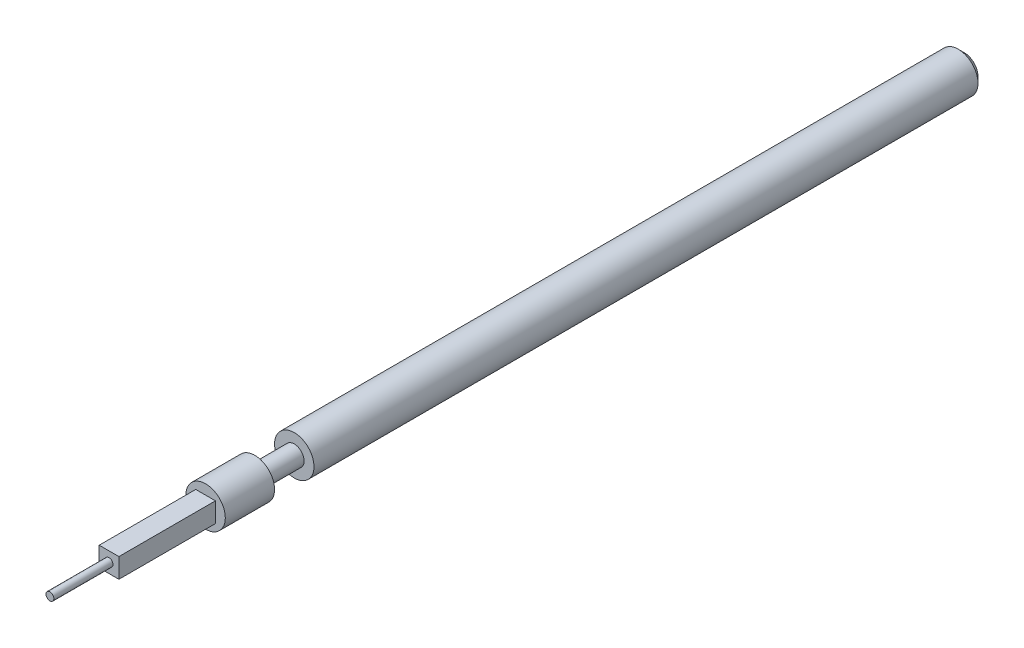
ISO-10303-21;
HEADER;
FILE_DESCRIPTION(('STEP AP214'),'2;1');
FILE_NAME('part.step','',(''),(''),'','','');
FILE_SCHEMA(('AUTOMOTIVE_DESIGN { 1 0 10303 214 1 1 1 1 }'));
ENDSEC;
DATA;
#1=APPLICATION_CONTEXT('core data for automotive mechanical design processes');
#2=APPLICATION_PROTOCOL_DEFINITION('international standard','automotive_design',2000,#1);
#3=PRODUCT_CONTEXT('',#1,'mechanical');
#4=PRODUCT('Part','Part','',(#3));
#5=PRODUCT_RELATED_PRODUCT_CATEGORY('part','',(#4));
#6=PRODUCT_DEFINITION_FORMATION('','',#4);
#7=PRODUCT_DEFINITION_CONTEXT('part definition',#1,'design');
#8=PRODUCT_DEFINITION('design','',#6,#7);
#9=PRODUCT_DEFINITION_SHAPE('','',#8);
#10=(LENGTH_UNIT() NAMED_UNIT(*) SI_UNIT(.MILLI.,.METRE.));
#11=(NAMED_UNIT(*) PLANE_ANGLE_UNIT() SI_UNIT($,.RADIAN.));
#12=(NAMED_UNIT(*) SI_UNIT($,.STERADIAN.) SOLID_ANGLE_UNIT());
#13=UNCERTAINTY_MEASURE_WITH_UNIT(LENGTH_MEASURE(1.E-05),#10,'distance_accuracy_value','');
#14=(GEOMETRIC_REPRESENTATION_CONTEXT(3) GLOBAL_UNCERTAINTY_ASSIGNED_CONTEXT((#13)) GLOBAL_UNIT_ASSIGNED_CONTEXT((#10,
#11,#12)) REPRESENTATION_CONTEXT('',''));
#15=CARTESIAN_POINT('',(0.,0.,0.));
#16=DIRECTION('',(0.,0.,1.));
#17=DIRECTION('',(1.,0.,0.));
#18=AXIS2_PLACEMENT_3D('',#15,#16,#17);
#19=CARTESIAN_POINT('',(-0.25,-0.25,21.7));
#20=DIRECTION('',(0.,0.,1.));
#21=DIRECTION('',(1.,0.,0.));
#22=AXIS2_PLACEMENT_3D('',#19,#20,#21);
#23=PLANE('',#22);
#24=DIRECTION('',(0.,-1.,0.));
#25=VECTOR('',#24,1.);
#26=CARTESIAN_POINT('',(-0.25,0.25,21.7));
#27=LINE('',#26,#25);
#28=CARTESIAN_POINT('',(-0.25,0.25,21.7));
#29=VERTEX_POINT('',#28);
#30=CARTESIAN_POINT('',(-0.25,-0.25,21.7));
#31=VERTEX_POINT('',#30);
#32=EDGE_CURVE('E89',#29,#31,#27,.T.);
#33=ORIENTED_EDGE('',*,*,#32,.T.);
#34=DIRECTION('',(1.,0.,0.));
#35=VECTOR('',#34,1.);
#36=CARTESIAN_POINT('',(-0.25,-0.25,21.7));
#37=LINE('',#36,#35);
#38=CARTESIAN_POINT('',(0.25,-0.25,21.7));
#39=VERTEX_POINT('',#38);
#40=EDGE_CURVE('E84',#31,#39,#37,.T.);
#41=ORIENTED_EDGE('',*,*,#40,.T.);
#42=DIRECTION('',(0.,1.,0.));
#43=VECTOR('',#42,1.);
#44=CARTESIAN_POINT('',(0.25,0.25,21.7));
#45=LINE('',#44,#43);
#46=CARTESIAN_POINT('',(0.25,0.25,21.7));
#47=VERTEX_POINT('',#46);
#48=EDGE_CURVE('E87',#39,#47,#45,.T.);
#49=ORIENTED_EDGE('',*,*,#48,.T.);
#50=DIRECTION('',(-1.,0.,0.));
#51=VECTOR('',#50,1.);
#52=CARTESIAN_POINT('',(-0.25,0.25,21.7));
#53=LINE('',#52,#51);
#54=EDGE_CURVE('E63',#47,#29,#53,.T.);
#55=ORIENTED_EDGE('',*,*,#54,.T.);
#56=EDGE_LOOP('',(#33,#41,#49,#55));
#57=FACE_BOUND('',#56,.T.);
#58=CARTESIAN_POINT('',(0.,0.,21.7));
#59=DIRECTION('',(0.,0.,1.));
#60=DIRECTION('',(1.,0.,0.));
#61=AXIS2_PLACEMENT_3D('',#58,#59,#60);
#62=CIRCLE('',#61,0.1);
#63=CARTESIAN_POINT('',(0.1,0.,21.7));
#64=VERTEX_POINT('',#63);
#65=EDGE_CURVE('E280',#64,#64,#62,.T.);
#66=ORIENTED_EDGE('',*,*,#65,.F.);
#67=EDGE_LOOP('',(#66));
#68=FACE_BOUND('',#67,.T.);
#69=ADVANCED_FACE('F40',(#57,#68),#23,.T.);
#70=CARTESIAN_POINT('',(0.,0.,19.25));
#71=DIRECTION('',(0.,0.,1.));
#72=DIRECTION('',(1.,0.,0.));
#73=AXIS2_PLACEMENT_3D('',#70,#71,#72);
#74=PLANE('',#73);
#75=CARTESIAN_POINT('',(0.,0.,19.25));
#76=DIRECTION('',(0.,0.,1.));
#77=DIRECTION('',(1.,0.,0.));
#78=AXIS2_PLACEMENT_3D('',#75,#76,#77);
#79=CIRCLE('',#78,0.5);
#80=CARTESIAN_POINT('',(0.5,0.,19.25));
#81=VERTEX_POINT('',#80);
#82=EDGE_CURVE('E119',#81,#81,#79,.T.);
#83=ORIENTED_EDGE('',*,*,#82,.T.);
#84=EDGE_LOOP('',(#83));
#85=FACE_BOUND('',#84,.T.);
#86=DIRECTION('',(1.,0.,0.));
#87=VECTOR('',#86,1.);
#88=CARTESIAN_POINT('',(-0.25,-0.25,19.25));
#89=LINE('',#88,#87);
#90=CARTESIAN_POINT('',(-0.25,-0.25,19.25));
#91=VERTEX_POINT('',#90);
#92=CARTESIAN_POINT('',(0.25,-0.25,19.25));
#93=VERTEX_POINT('',#92);
#94=EDGE_CURVE('E96',#91,#93,#89,.T.);
#95=ORIENTED_EDGE('',*,*,#94,.F.);
#96=DIRECTION('',(0.,-1.,0.));
#97=VECTOR('',#96,1.);
#98=CARTESIAN_POINT('',(-0.25,0.25,19.25));
#99=LINE('',#98,#97);
#100=CARTESIAN_POINT('',(-0.25,0.25,19.25));
#101=VERTEX_POINT('',#100);
#102=EDGE_CURVE('E107',#101,#91,#99,.T.);
#103=ORIENTED_EDGE('',*,*,#102,.F.);
#104=DIRECTION('',(-1.,0.,0.));
#105=VECTOR('',#104,1.);
#106=CARTESIAN_POINT('',(-0.25,0.25,19.25));
#107=LINE('',#106,#105);
#108=CARTESIAN_POINT('',(0.25,0.25,19.25));
#109=VERTEX_POINT('',#108);
#110=EDGE_CURVE('E77',#109,#101,#107,.T.);
#111=ORIENTED_EDGE('',*,*,#110,.F.);
#112=DIRECTION('',(0.,1.,0.));
#113=VECTOR('',#112,1.);
#114=CARTESIAN_POINT('',(0.25,0.25,19.25));
#115=LINE('',#114,#113);
#116=EDGE_CURVE('E112',#93,#109,#115,.T.);
#117=ORIENTED_EDGE('',*,*,#116,.F.);
#118=EDGE_LOOP('',(#95,#103,#111,#117));
#119=FACE_BOUND('',#118,.T.);
#120=ADVANCED_FACE('F153',(#85,#119),#74,.T.);
#121=CARTESIAN_POINT('',(0.,0.,17.));
#122=DIRECTION('',(0.,0.,1.));
#123=DIRECTION('',(1.,0.,0.));
#124=AXIS2_PLACEMENT_3D('',#121,#122,#123);
#125=PLANE('',#124);
#126=CARTESIAN_POINT('',(0.,0.,17.));
#127=DIRECTION('',(0.,0.,1.));
#128=DIRECTION('',(1.,0.,0.));
#129=AXIS2_PLACEMENT_3D('',#126,#127,#128);
#130=CIRCLE('',#129,0.5);
#131=CARTESIAN_POINT('',(0.5,0.,17.));
#132=VERTEX_POINT('',#131);
#133=EDGE_CURVE('E128',#132,#132,#130,.T.);
#134=ORIENTED_EDGE('',*,*,#133,.T.);
#135=EDGE_LOOP('',(#134));
#136=FACE_BOUND('',#135,.T.);
#137=CARTESIAN_POINT('',(0.,0.,17.));
#138=DIRECTION('',(0.,0.,1.));
#139=DIRECTION('',(1.,0.,0.));
#140=AXIS2_PLACEMENT_3D('',#137,#138,#139);
#141=CIRCLE('',#140,0.25);
#142=CARTESIAN_POINT('',(0.25,0.,17.));
#143=VERTEX_POINT('',#142);
#144=EDGE_CURVE('E122',#143,#143,#141,.T.);
#145=ORIENTED_EDGE('',*,*,#144,.F.);
#146=EDGE_LOOP('',(#145));
#147=FACE_BOUND('',#146,.T.);
#148=ADVANCED_FACE('F158',(#136,#147),#125,.T.);
#149=CARTESIAN_POINT('',(0.,0.,17.));
#150=DIRECTION('',(0.,0.,-1.));
#151=DIRECTION('',(-1.,0.,0.));
#152=AXIS2_PLACEMENT_3D('',#149,#150,#151);
#153=CYLINDRICAL_SURFACE('',#152,0.5);
#154=CARTESIAN_POINT('',(0.,0.,0.149999999999997));
#155=DIRECTION('',(0.,0.,1.));
#156=DIRECTION('',(1.,0.,0.));
#157=AXIS2_PLACEMENT_3D('',#154,#155,#156);
#158=CIRCLE('',#157,0.5);
#159=CARTESIAN_POINT('',(0.5,0.,0.149999999999997));
#160=VERTEX_POINT('',#159);
#161=EDGE_CURVE('E48',#160,#160,#158,.T.);
#162=ORIENTED_EDGE('',*,*,#161,.T.);
#163=EDGE_LOOP('',(#162));
#164=FACE_BOUND('',#163,.T.);
#165=ORIENTED_EDGE('',*,*,#133,.F.);
#166=EDGE_LOOP('',(#165));
#167=FACE_BOUND('',#166,.T.);
#168=ADVANCED_FACE('F135',(#164,#167),#153,.T.);
#169=CARTESIAN_POINT('',(0.,0.,0.));
#170=DIRECTION('',(0.,0.,1.));
#171=DIRECTION('',(1.,0.,0.));
#172=AXIS2_PLACEMENT_3D('',#169,#170,#171);
#173=PLANE('',#172);
#174=CARTESIAN_POINT('',(0.,0.,0.));
#175=DIRECTION('',(0.,0.,1.));
#176=DIRECTION('',(1.,0.,0.));
#177=AXIS2_PLACEMENT_3D('',#174,#175,#176);
#178=CIRCLE('',#177,0.35);
#179=CARTESIAN_POINT('',(0.35,0.,0.));
#180=VERTEX_POINT('',#179);
#181=EDGE_CURVE('E11',#180,#180,#178,.F.);
#182=ORIENTED_EDGE('',*,*,#181,.T.);
#183=EDGE_LOOP('',(#182));
#184=FACE_BOUND('',#183,.T.);
#185=ADVANCED_FACE('F140',(#184),#173,.F.);
#186=CARTESIAN_POINT('',(0.,0.,0.149999999999997));
#187=DIRECTION('',(0.,0.,1.));
#188=DIRECTION('',(1.,0.,0.));
#189=AXIS2_PLACEMENT_3D('',#186,#187,#188);
#190=CONICAL_SURFACE('',#189,0.5,0.78539816339746);
#191=ORIENTED_EDGE('',*,*,#181,.F.);
#192=EDGE_LOOP('',(#191));
#193=FACE_BOUND('',#192,.T.);
#194=ORIENTED_EDGE('',*,*,#161,.F.);
#195=EDGE_LOOP('',(#194));
#196=FACE_BOUND('',#195,.T.);
#197=ADVANCED_FACE('F42',(#193,#196),#190,.T.);
#198=CARTESIAN_POINT('',(0.,0.,18.));
#199=DIRECTION('',(0.,0.,-1.));
#200=DIRECTION('',(-1.,0.,0.));
#201=AXIS2_PLACEMENT_3D('',#198,#199,#200);
#202=CYLINDRICAL_SURFACE('',#201,0.25);
#203=CARTESIAN_POINT('',(0.,0.,18.));
#204=DIRECTION('',(0.,0.,1.));
#205=DIRECTION('',(1.,0.,0.));
#206=AXIS2_PLACEMENT_3D('',#203,#204,#205);
#207=CIRCLE('',#206,0.25);
#208=CARTESIAN_POINT('',(0.25,0.,18.));
#209=VERTEX_POINT('',#208);
#210=EDGE_CURVE('E125',#209,#209,#207,.T.);
#211=ORIENTED_EDGE('',*,*,#210,.F.);
#212=EDGE_LOOP('',(#211));
#213=FACE_BOUND('',#212,.T.);
#214=ORIENTED_EDGE('',*,*,#144,.T.);
#215=EDGE_LOOP('',(#214));
#216=FACE_BOUND('',#215,.T.);
#217=ADVANCED_FACE('F139',(#213,#216),#202,.T.);
#218=CARTESIAN_POINT('',(0.,0.,18.));
#219=DIRECTION('',(0.,0.,1.));
#220=DIRECTION('',(1.,0.,0.));
#221=AXIS2_PLACEMENT_3D('',#218,#219,#220);
#222=PLANE('',#221);
#223=CARTESIAN_POINT('',(0.,0.,18.));
#224=DIRECTION('',(0.,0.,1.));
#225=DIRECTION('',(1.,0.,0.));
#226=AXIS2_PLACEMENT_3D('',#223,#224,#225);
#227=CIRCLE('',#226,0.5);
#228=CARTESIAN_POINT('',(0.5,0.,18.));
#229=VERTEX_POINT('',#228);
#230=EDGE_CURVE('E118',#229,#229,#227,.T.);
#231=ORIENTED_EDGE('',*,*,#230,.F.);
#232=EDGE_LOOP('',(#231));
#233=FACE_BOUND('',#232,.T.);
#234=ORIENTED_EDGE('',*,*,#210,.T.);
#235=EDGE_LOOP('',(#234));
#236=FACE_BOUND('',#235,.T.);
#237=ADVANCED_FACE('F146',(#233,#236),#222,.F.);
#238=CARTESIAN_POINT('',(0.,0.,19.25));
#239=DIRECTION('',(0.,0.,-1.));
#240=DIRECTION('',(-1.,0.,0.));
#241=AXIS2_PLACEMENT_3D('',#238,#239,#240);
#242=CYLINDRICAL_SURFACE('',#241,0.5);
#243=ORIENTED_EDGE('',*,*,#82,.F.);
#244=EDGE_LOOP('',(#243));
#245=FACE_BOUND('',#244,.T.);
#246=ORIENTED_EDGE('',*,*,#230,.T.);
#247=EDGE_LOOP('',(#246));
#248=FACE_BOUND('',#247,.T.);
#249=ADVANCED_FACE('F174',(#245,#248),#242,.T.);
#250=CARTESIAN_POINT('',(-0.25,0.25,21.7));
#251=DIRECTION('',(1.,0.,0.));
#252=DIRECTION('',(0.,0.,-1.));
#253=AXIS2_PLACEMENT_3D('',#250,#251,#252);
#254=PLANE('',#253);
#255=ORIENTED_EDGE('',*,*,#102,.T.);
#256=DIRECTION('',(0.,0.,-1.));
#257=VECTOR('',#256,1.);
#258=CARTESIAN_POINT('',(-0.25,-0.25,21.7));
#259=LINE('',#258,#257);
#260=EDGE_CURVE('E99',#31,#91,#259,.T.);
#261=ORIENTED_EDGE('',*,*,#260,.F.);
#262=ORIENTED_EDGE('',*,*,#32,.F.);
#263=DIRECTION('',(0.,0.,-1.));
#264=VECTOR('',#263,1.);
#265=CARTESIAN_POINT('',(-0.25,0.25,21.7));
#266=LINE('',#265,#264);
#267=EDGE_CURVE('E103',#29,#101,#266,.T.);
#268=ORIENTED_EDGE('',*,*,#267,.T.);
#269=EDGE_LOOP('',(#255,#261,#262,#268));
#270=FACE_BOUND('',#269,.T.);
#271=ADVANCED_FACE('F172',(#270),#254,.F.);
#272=CARTESIAN_POINT('',(-0.25,-0.25,21.7));
#273=DIRECTION('',(0.,1.,0.));
#274=DIRECTION('',(0.,0.,1.));
#275=AXIS2_PLACEMENT_3D('',#272,#273,#274);
#276=PLANE('',#275);
#277=ORIENTED_EDGE('',*,*,#94,.T.);
#278=DIRECTION('',(0.,0.,-1.));
#279=VECTOR('',#278,1.);
#280=CARTESIAN_POINT('',(0.25,-0.25,21.7));
#281=LINE('',#280,#279);
#282=EDGE_CURVE('E93',#39,#93,#281,.T.);
#283=ORIENTED_EDGE('',*,*,#282,.F.);
#284=ORIENTED_EDGE('',*,*,#40,.F.);
#285=ORIENTED_EDGE('',*,*,#260,.T.);
#286=EDGE_LOOP('',(#277,#283,#284,#285));
#287=FACE_BOUND('',#286,.T.);
#288=ADVANCED_FACE('F94',(#287),#276,.F.);
#289=CARTESIAN_POINT('',(0.25,0.25,21.7));
#290=DIRECTION('',(-1.,0.,0.));
#291=DIRECTION('',(0.,-1.,0.));
#292=AXIS2_PLACEMENT_3D('',#289,#290,#291);
#293=PLANE('',#292);
#294=ORIENTED_EDGE('',*,*,#116,.T.);
#295=DIRECTION('',(0.,0.,-1.));
#296=VECTOR('',#295,1.);
#297=CARTESIAN_POINT('',(0.25,0.25,21.7));
#298=LINE('',#297,#296);
#299=EDGE_CURVE('E55',#47,#109,#298,.T.);
#300=ORIENTED_EDGE('',*,*,#299,.F.);
#301=ORIENTED_EDGE('',*,*,#48,.F.);
#302=ORIENTED_EDGE('',*,*,#282,.T.);
#303=EDGE_LOOP('',(#294,#300,#301,#302));
#304=FACE_BOUND('',#303,.T.);
#305=ADVANCED_FACE('F101',(#304),#293,.F.);
#306=CARTESIAN_POINT('',(-0.25,0.25,21.7));
#307=DIRECTION('',(0.,-1.,0.));
#308=DIRECTION('',(0.,0.,-1.));
#309=AXIS2_PLACEMENT_3D('',#306,#307,#308);
#310=PLANE('',#309);
#311=ORIENTED_EDGE('',*,*,#110,.T.);
#312=ORIENTED_EDGE('',*,*,#267,.F.);
#313=ORIENTED_EDGE('',*,*,#54,.F.);
#314=ORIENTED_EDGE('',*,*,#299,.T.);
#315=EDGE_LOOP('',(#311,#312,#313,#314));
#316=FACE_BOUND('',#315,.T.);
#317=ADVANCED_FACE('F165',(#316),#310,.F.);
#318=CARTESIAN_POINT('',(0.,0.,23.2));
#319=DIRECTION('',(0.,0.,-1.));
#320=DIRECTION('',(-1.,0.,0.));
#321=AXIS2_PLACEMENT_3D('',#318,#319,#320);
#322=CYLINDRICAL_SURFACE('',#321,0.1);
#323=CARTESIAN_POINT('',(0.,0.,23.2));
#324=DIRECTION('',(0.,0.,1.));
#325=DIRECTION('',(1.,0.,0.));
#326=AXIS2_PLACEMENT_3D('',#323,#324,#325);
#327=CIRCLE('',#326,0.1);
#328=CARTESIAN_POINT('',(0.1,0.,23.2));
#329=VERTEX_POINT('',#328);
#330=EDGE_CURVE('E110',#329,#329,#327,.T.);
#331=ORIENTED_EDGE('',*,*,#330,.F.);
#332=EDGE_LOOP('',(#331));
#333=FACE_BOUND('',#332,.T.);
#334=ORIENTED_EDGE('',*,*,#65,.T.);
#335=EDGE_LOOP('',(#334));
#336=FACE_BOUND('',#335,.T.);
#337=ADVANCED_FACE('F163',(#333,#336),#322,.T.);
#338=CARTESIAN_POINT('',(0.,0.,23.2));
#339=DIRECTION('',(0.,0.,1.));
#340=DIRECTION('',(1.,0.,0.));
#341=AXIS2_PLACEMENT_3D('',#338,#339,#340);
#342=PLANE('',#341);
#343=ORIENTED_EDGE('',*,*,#330,.T.);
#344=EDGE_LOOP('',(#343));
#345=FACE_BOUND('',#344,.T.);
#346=ADVANCED_FACE('F266',(#345),#342,.T.);
#347=CLOSED_SHELL('',(#69,#120,#148,#168,#185,#197,#217,#237,#249,#271,#288,#305,#317,#337,#346));
#348=MANIFOLD_SOLID_BREP('B2',#347);
#349=ADVANCED_BREP_SHAPE_REPRESENTATION('',(#18,#348),#14);
#350=SHAPE_DEFINITION_REPRESENTATION(#9,#349);
ENDSEC;
END-ISO-10303-21;
